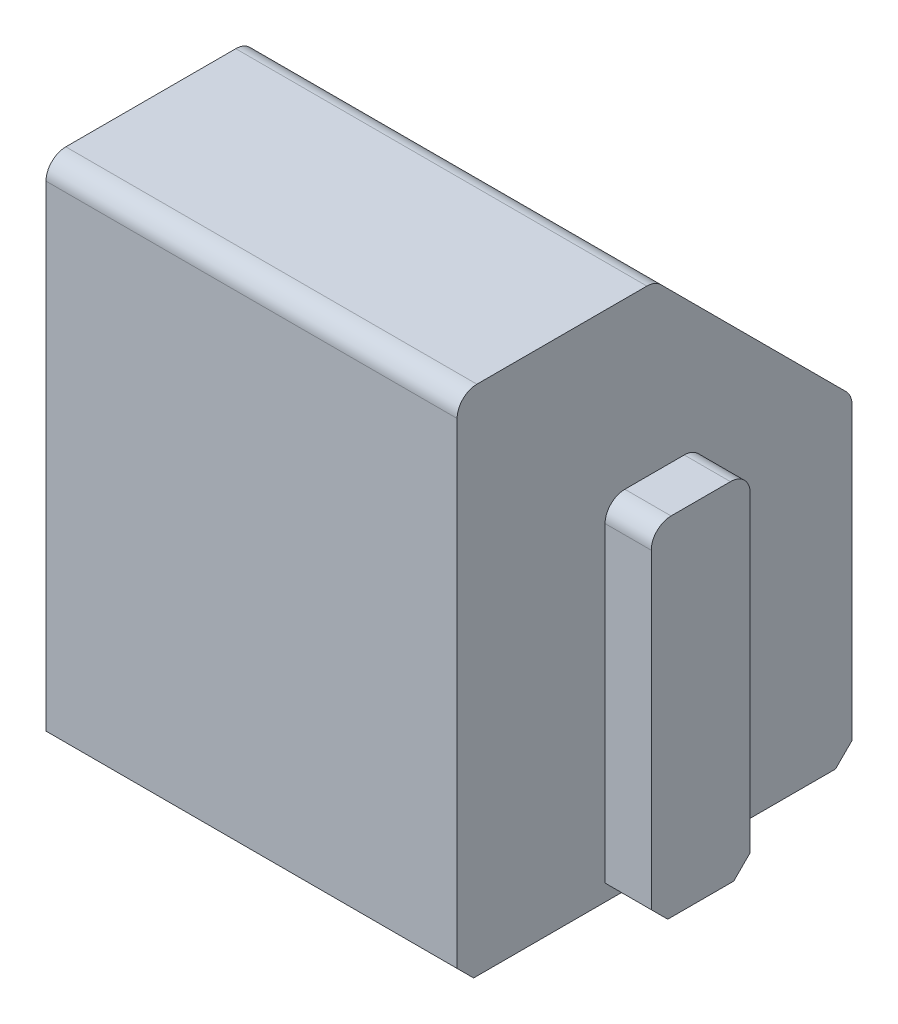
ISO-10303-21;
HEADER;
FILE_DESCRIPTION(('STEP AP214'),'2;1');
FILE_NAME('part.step','',(''),(''),'','','');
FILE_SCHEMA(('AUTOMOTIVE_DESIGN { 1 0 10303 214 1 1 1 1 }'));
ENDSEC;
DATA;
#1=APPLICATION_CONTEXT('core data for automotive mechanical design processes');
#2=APPLICATION_PROTOCOL_DEFINITION('international standard','automotive_design',2000,#1);
#3=PRODUCT_CONTEXT('',#1,'mechanical');
#4=PRODUCT('Part','Part','',(#3));
#5=PRODUCT_RELATED_PRODUCT_CATEGORY('part','',(#4));
#6=PRODUCT_DEFINITION_FORMATION('','',#4);
#7=PRODUCT_DEFINITION_CONTEXT('part definition',#1,'design');
#8=PRODUCT_DEFINITION('design','',#6,#7);
#9=PRODUCT_DEFINITION_SHAPE('','',#8);
#10=(LENGTH_UNIT() NAMED_UNIT(*) SI_UNIT(.MILLI.,.METRE.));
#11=(NAMED_UNIT(*) PLANE_ANGLE_UNIT() SI_UNIT($,.RADIAN.));
#12=(NAMED_UNIT(*) SI_UNIT($,.STERADIAN.) SOLID_ANGLE_UNIT());
#13=UNCERTAINTY_MEASURE_WITH_UNIT(LENGTH_MEASURE(1.E-05),#10,'distance_accuracy_value','');
#14=(GEOMETRIC_REPRESENTATION_CONTEXT(3) GLOBAL_UNCERTAINTY_ASSIGNED_CONTEXT((#13)) GLOBAL_UNIT_ASSIGNED_CONTEXT((#10,
#11,#12)) REPRESENTATION_CONTEXT('',''));
#15=CARTESIAN_POINT('',(0.,0.,0.));
#16=DIRECTION('',(0.,0.,1.));
#17=DIRECTION('',(1.,0.,0.));
#18=AXIS2_PLACEMENT_3D('',#15,#16,#17);
#19=CARTESIAN_POINT('',(6.23,-38.984,-49.));
#20=DIRECTION('',(0.,0.,-1.));
#21=DIRECTION('',(-1.,0.,0.));
#22=AXIS2_PLACEMENT_3D('',#19,#20,#21);
#23=PLANE('',#22);
#24=DIRECTION('',(0.,-1.,0.));
#25=VECTOR('',#24,1.);
#26=CARTESIAN_POINT('',(-6.23,-38.984,-49.));
#27=LINE('',#26,#25);
#28=CARTESIAN_POINT('',(-6.23,-39.584,-49.));
#29=VERTEX_POINT('',#28);
#30=CARTESIAN_POINT('',(-6.23,-54.02,-49.));
#31=VERTEX_POINT('',#30);
#32=EDGE_CURVE('E230',#29,#31,#27,.T.);
#33=ORIENTED_EDGE('',*,*,#32,.T.);
#34=DIRECTION('',(1.,0.,0.));
#35=VECTOR('',#34,1.);
#36=CARTESIAN_POINT('',(6.23,-54.02,-49.));
#37=LINE('',#36,#35);
#38=CARTESIAN_POINT('',(6.23,-54.02,-49.));
#39=VERTEX_POINT('',#38);
#40=EDGE_CURVE('E41',#31,#39,#37,.T.);
#41=ORIENTED_EDGE('',*,*,#40,.T.);
#42=DIRECTION('',(0.,-1.,0.));
#43=VECTOR('',#42,1.);
#44=CARTESIAN_POINT('',(6.23,-38.984,-49.));
#45=LINE('',#44,#43);
#46=CARTESIAN_POINT('',(6.23,-39.584,-49.));
#47=VERTEX_POINT('',#46);
#48=EDGE_CURVE('E232',#47,#39,#45,.T.);
#49=ORIENTED_EDGE('',*,*,#48,.F.);
#50=DIRECTION('',(-1.,0.,0.));
#51=VECTOR('',#50,1.);
#52=CARTESIAN_POINT('',(6.23,-39.584,-49.));
#53=LINE('',#52,#51);
#54=EDGE_CURVE('E286',#47,#29,#53,.T.);
#55=ORIENTED_EDGE('',*,*,#54,.T.);
#56=EDGE_LOOP('',(#33,#41,#49,#55));
#57=FACE_BOUND('',#56,.T.);
#58=ADVANCED_FACE('F17',(#57),#23,.F.);
#59=CARTESIAN_POINT('',(6.23,-54.52,-49.));
#60=DIRECTION('',(0.,1.,0.));
#61=DIRECTION('',(0.,0.,1.));
#62=AXIS2_PLACEMENT_3D('',#59,#60,#61);
#63=PLANE('',#62);
#64=CARTESIAN_POINT('',(0.,-54.52,-54.984));
#65=DIRECTION('',(0.,1.,0.));
#66=DIRECTION('',(0.,0.,1.));
#67=AXIS2_PLACEMENT_3D('',#64,#65,#66);
#68=CIRCLE('',#67,4.);
#69=CARTESIAN_POINT('',(0.,-54.52,-50.984));
#70=VERTEX_POINT('',#69);
#71=EDGE_CURVE('E315',#70,#70,#68,.T.);
#72=ORIENTED_EDGE('',*,*,#71,.T.);
#73=EDGE_LOOP('',(#72));
#74=FACE_BOUND('',#73,.T.);
#75=DIRECTION('',(0.,0.,-1.));
#76=VECTOR('',#75,1.);
#77=CARTESIAN_POINT('',(-7.63,-54.52,-53.484));
#78=LINE('',#77,#76);
#79=CARTESIAN_POINT('',(-7.63,-54.52,-53.984));
#80=VERTEX_POINT('',#79);
#81=CARTESIAN_POINT('',(-7.63,-54.52,-55.984));
#82=VERTEX_POINT('',#81);
#83=EDGE_CURVE('E398',#80,#82,#78,.T.);
#84=ORIENTED_EDGE('',*,*,#83,.T.);
#85=DIRECTION('',(1.,0.,0.));
#86=VECTOR('',#85,1.);
#87=CARTESIAN_POINT('',(-6.23,-54.52,-55.984));
#88=LINE('',#87,#86);
#89=CARTESIAN_POINT('',(-6.23,-54.52,-55.984));
#90=VERTEX_POINT('',#89);
#91=EDGE_CURVE('E330',#82,#90,#88,.T.);
#92=ORIENTED_EDGE('',*,*,#91,.T.);
#93=DIRECTION('',(0.,0.,-1.));
#94=VECTOR('',#93,1.);
#95=CARTESIAN_POINT('',(-6.23,-54.52,-49.));
#96=LINE('',#95,#94);
#97=CARTESIAN_POINT('',(-6.23,-54.52,-60.468));
#98=VERTEX_POINT('',#97);
#99=EDGE_CURVE('E246',#90,#98,#96,.T.);
#100=ORIENTED_EDGE('',*,*,#99,.T.);
#101=DIRECTION('',(1.,0.,0.));
#102=VECTOR('',#101,1.);
#103=CARTESIAN_POINT('',(6.23,-54.52,-60.468));
#104=LINE('',#103,#102);
#105=CARTESIAN_POINT('',(6.23,-54.52,-60.468));
#106=VERTEX_POINT('',#105);
#107=EDGE_CURVE('E318',#98,#106,#104,.T.);
#108=ORIENTED_EDGE('',*,*,#107,.T.);
#109=DIRECTION('',(0.,0.,-1.));
#110=VECTOR('',#109,1.);
#111=CARTESIAN_POINT('',(6.23,-54.52,-49.));
#112=LINE('',#111,#110);
#113=CARTESIAN_POINT('',(6.23,-54.52,-55.984));
#114=VERTEX_POINT('',#113);
#115=EDGE_CURVE('E234',#114,#106,#112,.T.);
#116=ORIENTED_EDGE('',*,*,#115,.F.);
#117=DIRECTION('',(1.,0.,0.));
#118=VECTOR('',#117,1.);
#119=CARTESIAN_POINT('',(6.23,-54.52,-55.984));
#120=LINE('',#119,#118);
#121=CARTESIAN_POINT('',(7.63,-54.52,-55.984));
#122=VERTEX_POINT('',#121);
#123=EDGE_CURVE('E326',#114,#122,#120,.T.);
#124=ORIENTED_EDGE('',*,*,#123,.T.);
#125=DIRECTION('',(0.,0.,-1.));
#126=VECTOR('',#125,1.);
#127=CARTESIAN_POINT('',(7.63,-54.52,-53.484));
#128=LINE('',#127,#126);
#129=CARTESIAN_POINT('',(7.63,-54.52,-53.984));
#130=VERTEX_POINT('',#129);
#131=EDGE_CURVE('E231',#130,#122,#128,.T.);
#132=ORIENTED_EDGE('',*,*,#131,.F.);
#133=DIRECTION('',(-1.,0.,0.));
#134=VECTOR('',#133,1.);
#135=CARTESIAN_POINT('',(6.23,-54.52,-53.984));
#136=LINE('',#135,#134);
#137=CARTESIAN_POINT('',(6.23,-54.52,-53.984));
#138=VERTEX_POINT('',#137);
#139=EDGE_CURVE('E323',#130,#138,#136,.T.);
#140=ORIENTED_EDGE('',*,*,#139,.T.);
#141=CARTESIAN_POINT('',(6.23,-54.52,-49.5));
#142=VERTEX_POINT('',#141);
#143=EDGE_CURVE('E236',#142,#138,#112,.T.);
#144=ORIENTED_EDGE('',*,*,#143,.F.);
#145=DIRECTION('',(-1.,0.,0.));
#146=VECTOR('',#145,1.);
#147=CARTESIAN_POINT('',(6.23,-54.52,-49.5));
#148=LINE('',#147,#146);
#149=CARTESIAN_POINT('',(-6.23,-54.52,-49.5));
#150=VERTEX_POINT('',#149);
#151=EDGE_CURVE('E320',#142,#150,#148,.T.);
#152=ORIENTED_EDGE('',*,*,#151,.T.);
#153=CARTESIAN_POINT('',(-6.23,-54.52,-53.984));
#154=VERTEX_POINT('',#153);
#155=EDGE_CURVE('E247',#150,#154,#96,.T.);
#156=ORIENTED_EDGE('',*,*,#155,.T.);
#157=DIRECTION('',(-1.,0.,0.));
#158=VECTOR('',#157,1.);
#159=CARTESIAN_POINT('',(-7.63,-54.52,-53.984));
#160=LINE('',#159,#158);
#161=EDGE_CURVE('E328',#154,#80,#160,.T.);
#162=ORIENTED_EDGE('',*,*,#161,.T.);
#163=EDGE_LOOP('',(#84,#92,#100,#108,#116,#124,#132,#140,#144,#152,#156,#162));
#164=FACE_BOUND('',#163,.T.);
#165=ADVANCED_FACE('F380',(#74,#164),#63,.F.);
#166=CARTESIAN_POINT('',(6.23,-44.952,-60.968));
#167=DIRECTION('',(0.,0.,1.));
#168=DIRECTION('',(0.,-1.,0.));
#169=AXIS2_PLACEMENT_3D('',#166,#167,#168);
#170=PLANE('',#169);
#171=DIRECTION('',(0.,1.,0.));
#172=VECTOR('',#171,1.);
#173=CARTESIAN_POINT('',(6.23,-44.952,-60.968));
#174=LINE('',#173,#172);
#175=CARTESIAN_POINT('',(6.23,-54.02,-60.968));
#176=VERTEX_POINT('',#175);
#177=CARTESIAN_POINT('',(6.23,-45.2005281374239,-60.968));
#178=VERTEX_POINT('',#177);
#179=EDGE_CURVE('E238',#176,#178,#174,.T.);
#180=ORIENTED_EDGE('',*,*,#179,.F.);
#181=DIRECTION('',(-1.,0.,0.));
#182=VECTOR('',#181,1.);
#183=CARTESIAN_POINT('',(6.23,-54.02,-60.968));
#184=LINE('',#183,#182);
#185=CARTESIAN_POINT('',(-6.23,-54.02,-60.968));
#186=VERTEX_POINT('',#185);
#187=EDGE_CURVE('E359',#176,#186,#184,.T.);
#188=ORIENTED_EDGE('',*,*,#187,.T.);
#189=DIRECTION('',(0.,1.,0.));
#190=VECTOR('',#189,1.);
#191=CARTESIAN_POINT('',(-6.23,-44.952,-60.968));
#192=LINE('',#191,#190);
#193=CARTESIAN_POINT('',(-6.23,-45.2005281374239,-60.968));
#194=VERTEX_POINT('',#193);
#195=EDGE_CURVE('E249',#186,#194,#192,.T.);
#196=ORIENTED_EDGE('',*,*,#195,.T.);
#197=DIRECTION('',(-1.,0.,0.));
#198=VECTOR('',#197,1.);
#199=CARTESIAN_POINT('',(6.23,-45.2005281374239,-60.968));
#200=LINE('',#199,#198);
#201=EDGE_CURVE('E312',#194,#178,#200,.F.);
#202=ORIENTED_EDGE('',*,*,#201,.T.);
#203=EDGE_LOOP('',(#180,#188,#196,#202));
#204=FACE_BOUND('',#203,.T.);
#205=ADVANCED_FACE('F437',(#204),#170,.F.);
#206=CARTESIAN_POINT('',(6.23,-38.984,-55.));
#207=DIRECTION('',(0.,-0.707106781186547,0.707106781186549));
#208=DIRECTION('',(0.,-0.707106781186549,-0.707106781186547));
#209=AXIS2_PLACEMENT_3D('',#206,#207,#208);
#210=PLANE('',#209);
#211=DIRECTION('',(0.,0.707106781186549,0.707106781186546));
#212=VECTOR('',#211,1.);
#213=CARTESIAN_POINT('',(-6.23,-38.984,-55.));
#214=LINE('',#213,#212);
#215=CARTESIAN_POINT('',(-6.23,-44.7762640687119,-60.7922640687119));
#216=VERTEX_POINT('',#215);
#217=CARTESIAN_POINT('',(-6.23,-39.159735931288,-55.1757359312881));
#218=VERTEX_POINT('',#217);
#219=EDGE_CURVE('E251',#216,#218,#214,.T.);
#220=ORIENTED_EDGE('',*,*,#219,.T.);
#221=DIRECTION('',(-1.,0.,0.));
#222=VECTOR('',#221,1.);
#223=CARTESIAN_POINT('',(6.23,-39.159735931288,-55.1757359312881));
#224=LINE('',#223,#222);
#225=CARTESIAN_POINT('',(6.23,-39.159735931288,-55.1757359312881));
#226=VERTEX_POINT('',#225);
#227=EDGE_CURVE('E310',#218,#226,#224,.F.);
#228=ORIENTED_EDGE('',*,*,#227,.T.);
#229=DIRECTION('',(0.,0.707106781186549,0.707106781186546));
#230=VECTOR('',#229,1.);
#231=CARTESIAN_POINT('',(6.23,-38.984,-55.));
#232=LINE('',#231,#230);
#233=CARTESIAN_POINT('',(6.23,-44.7762640687119,-60.7922640687119));
#234=VERTEX_POINT('',#233);
#235=EDGE_CURVE('E240',#234,#226,#232,.T.);
#236=ORIENTED_EDGE('',*,*,#235,.F.);
#237=DIRECTION('',(-1.,0.,0.));
#238=VECTOR('',#237,1.);
#239=CARTESIAN_POINT('',(6.23,-44.7762640687119,-60.7922640687119));
#240=LINE('',#239,#238);
#241=EDGE_CURVE('E307',#234,#216,#240,.T.);
#242=ORIENTED_EDGE('',*,*,#241,.T.);
#243=EDGE_LOOP('',(#220,#228,#236,#242));
#244=FACE_BOUND('',#243,.T.);
#245=ADVANCED_FACE('F526',(#244),#210,.F.);
#246=CARTESIAN_POINT('',(6.23,-38.984,-49.));
#247=DIRECTION('',(0.,-1.,0.));
#248=DIRECTION('',(0.,0.,-1.));
#249=AXIS2_PLACEMENT_3D('',#246,#247,#248);
#250=PLANE('',#249);
#251=DIRECTION('',(0.,0.,1.));
#252=VECTOR('',#251,1.);
#253=CARTESIAN_POINT('',(-6.23,-38.984,-49.));
#254=LINE('',#253,#252);
#255=CARTESIAN_POINT('',(-6.23,-38.984,-54.7514718625762));
#256=VERTEX_POINT('',#255);
#257=CARTESIAN_POINT('',(-6.23,-38.984,-49.6));
#258=VERTEX_POINT('',#257);
#259=EDGE_CURVE('E235',#256,#258,#254,.T.);
#260=ORIENTED_EDGE('',*,*,#259,.T.);
#261=DIRECTION('',(-1.,0.,0.));
#262=VECTOR('',#261,1.);
#263=CARTESIAN_POINT('',(6.23,-38.984,-49.6));
#264=LINE('',#263,#262);
#265=CARTESIAN_POINT('',(6.23,-38.984,-49.6));
#266=VERTEX_POINT('',#265);
#267=EDGE_CURVE('E299',#258,#266,#264,.F.);
#268=ORIENTED_EDGE('',*,*,#267,.T.);
#269=DIRECTION('',(0.,0.,1.));
#270=VECTOR('',#269,1.);
#271=CARTESIAN_POINT('',(6.23,-38.984,-49.));
#272=LINE('',#271,#270);
#273=CARTESIAN_POINT('',(6.23,-38.984,-54.7514718625762));
#274=VERTEX_POINT('',#273);
#275=EDGE_CURVE('E214',#274,#266,#272,.T.);
#276=ORIENTED_EDGE('',*,*,#275,.F.);
#277=DIRECTION('',(-1.,0.,0.));
#278=VECTOR('',#277,1.);
#279=CARTESIAN_POINT('',(6.23,-38.984,-54.7514718625762));
#280=LINE('',#279,#278);
#281=EDGE_CURVE('E296',#274,#256,#280,.T.);
#282=ORIENTED_EDGE('',*,*,#281,.T.);
#283=EDGE_LOOP('',(#260,#268,#276,#282));
#284=FACE_BOUND('',#283,.T.);
#285=ADVANCED_FACE('F532',(#284),#250,.F.);
#286=CARTESIAN_POINT('',(6.23,0.,0.));
#287=DIRECTION('',(1.,0.,0.));
#288=DIRECTION('',(0.,0.,-1.));
#289=AXIS2_PLACEMENT_3D('',#286,#287,#288);
#290=PLANE('',#289);
#291=ORIENTED_EDGE('',*,*,#48,.T.);
#292=DIRECTION('',(0.,0.707106781186548,0.707106781186548));
#293=VECTOR('',#292,1.);
#294=CARTESIAN_POINT('',(6.23,-2.51,2.51));
#295=LINE('',#294,#293);
#296=EDGE_CURVE('E357',#39,#142,#295,.F.);
#297=ORIENTED_EDGE('',*,*,#296,.T.);
#298=ORIENTED_EDGE('',*,*,#143,.T.);
#299=DIRECTION('',(0.,-0.707106781186548,-0.707106781186548));
#300=VECTOR('',#299,1.);
#301=CARTESIAN_POINT('',(6.23,-54.52,-53.984));
#302=LINE('',#301,#300);
#303=CARTESIAN_POINT('',(6.23,-54.02,-53.484));
#304=VERTEX_POINT('',#303);
#305=EDGE_CURVE('E11',#138,#304,#302,.F.);
#306=ORIENTED_EDGE('',*,*,#305,.T.);
#307=DIRECTION('',(0.,-1.,0.));
#308=VECTOR('',#307,1.);
#309=CARTESIAN_POINT('',(6.23,-43.984,-53.484));
#310=LINE('',#309,#308);
#311=CARTESIAN_POINT('',(6.23,-44.584,-53.484));
#312=VERTEX_POINT('',#311);
#313=EDGE_CURVE('E209',#312,#304,#310,.T.);
#314=ORIENTED_EDGE('',*,*,#313,.F.);
#315=CARTESIAN_POINT('',(6.23,-44.584,-54.084));
#316=DIRECTION('',(1.,0.,0.));
#317=DIRECTION('',(0.,0.,-1.));
#318=AXIS2_PLACEMENT_3D('',#315,#316,#317);
#319=CIRCLE('',#318,0.6);
#320=CARTESIAN_POINT('',(6.23,-43.984,-54.084));
#321=VERTEX_POINT('',#320);
#322=EDGE_CURVE('E193',#312,#321,#319,.F.);
#323=ORIENTED_EDGE('',*,*,#322,.T.);
#324=DIRECTION('',(0.,0.,1.));
#325=VECTOR('',#324,1.);
#326=CARTESIAN_POINT('',(6.23,-43.984,-53.484));
#327=LINE('',#326,#325);
#328=CARTESIAN_POINT('',(6.23,-43.984,-55.884));
#329=VERTEX_POINT('',#328);
#330=EDGE_CURVE('E219',#329,#321,#327,.T.);
#331=ORIENTED_EDGE('',*,*,#330,.F.);
#332=CARTESIAN_POINT('',(6.23,-44.584,-55.884));
#333=DIRECTION('',(1.,0.,0.));
#334=DIRECTION('',(0.,0.,-1.));
#335=AXIS2_PLACEMENT_3D('',#332,#333,#334);
#336=CIRCLE('',#335,0.6);
#337=CARTESIAN_POINT('',(6.23,-44.584,-56.484));
#338=VERTEX_POINT('',#337);
#339=EDGE_CURVE('E202',#329,#338,#336,.F.);
#340=ORIENTED_EDGE('',*,*,#339,.T.);
#341=DIRECTION('',(0.,1.,0.));
#342=VECTOR('',#341,1.);
#343=CARTESIAN_POINT('',(6.23,-43.984,-56.484));
#344=LINE('',#343,#342);
#345=CARTESIAN_POINT('',(6.23,-54.02,-56.484));
#346=VERTEX_POINT('',#345);
#347=EDGE_CURVE('E223',#346,#338,#344,.T.);
#348=ORIENTED_EDGE('',*,*,#347,.F.);
#349=DIRECTION('',(0.,0.707106781186548,-0.707106781186548));
#350=VECTOR('',#349,1.);
#351=CARTESIAN_POINT('',(6.23,-54.02,-56.484));
#352=LINE('',#351,#350);
#353=EDGE_CURVE('E26',#346,#114,#352,.F.);
#354=ORIENTED_EDGE('',*,*,#353,.T.);
#355=ORIENTED_EDGE('',*,*,#115,.T.);
#356=DIRECTION('',(0.,-0.707106781186548,0.707106781186548));
#357=VECTOR('',#356,1.);
#358=CARTESIAN_POINT('',(6.23,-57.494,-57.494));
#359=LINE('',#358,#357);
#360=EDGE_CURVE('E33',#106,#176,#359,.F.);
#361=ORIENTED_EDGE('',*,*,#360,.T.);
#362=ORIENTED_EDGE('',*,*,#179,.T.);
#363=CARTESIAN_POINT('',(6.23,-45.2005281374239,-60.368));
#364=DIRECTION('',(1.,0.,0.));
#365=DIRECTION('',(0.,0.,-1.));
#366=AXIS2_PLACEMENT_3D('',#363,#364,#365);
#367=CIRCLE('',#366,0.6);
#368=EDGE_CURVE('E301',#178,#234,#367,.T.);
#369=ORIENTED_EDGE('',*,*,#368,.T.);
#370=ORIENTED_EDGE('',*,*,#235,.T.);
#371=CARTESIAN_POINT('',(6.23,-39.584,-54.7514718625762));
#372=DIRECTION('',(1.,0.,0.));
#373=DIRECTION('',(0.,0.,-1.));
#374=AXIS2_PLACEMENT_3D('',#371,#372,#373);
#375=CIRCLE('',#374,0.6);
#376=EDGE_CURVE('E303',#226,#274,#375,.T.);
#377=ORIENTED_EDGE('',*,*,#376,.T.);
#378=ORIENTED_EDGE('',*,*,#275,.T.);
#379=CARTESIAN_POINT('',(6.23,-39.584,-49.6));
#380=DIRECTION('',(1.,0.,0.));
#381=DIRECTION('',(0.,0.,-1.));
#382=AXIS2_PLACEMENT_3D('',#379,#380,#381);
#383=CIRCLE('',#382,0.6);
#384=EDGE_CURVE('E305',#266,#47,#383,.T.);
#385=ORIENTED_EDGE('',*,*,#384,.T.);
#386=EDGE_LOOP('',(#291,#297,#298,#306,#314,#323,#331,#340,#348,#354,#355,#361,#362,#369,#370,
#377,#378,#385));
#387=FACE_BOUND('',#386,.T.);
#388=ADVANCED_FACE('F216',(#387),#290,.T.);
#389=CARTESIAN_POINT('',(-6.23,0.,0.));
#390=DIRECTION('',(1.,0.,0.));
#391=DIRECTION('',(0.,0.,-1.));
#392=AXIS2_PLACEMENT_3D('',#389,#390,#391);
#393=PLANE('',#392);
#394=ORIENTED_EDGE('',*,*,#155,.F.);
#395=DIRECTION('',(0.,-0.707106781186548,-0.707106781186548));
#396=VECTOR('',#395,1.);
#397=CARTESIAN_POINT('',(-6.23,-54.52,-49.5));
#398=LINE('',#397,#396);
#399=EDGE_CURVE('E353',#150,#31,#398,.F.);
#400=ORIENTED_EDGE('',*,*,#399,.T.);
#401=ORIENTED_EDGE('',*,*,#32,.F.);
#402=CARTESIAN_POINT('',(-6.23,-39.584,-49.6));
#403=DIRECTION('',(1.,0.,0.));
#404=DIRECTION('',(0.,0.,-1.));
#405=AXIS2_PLACEMENT_3D('',#402,#403,#404);
#406=CIRCLE('',#405,0.6);
#407=EDGE_CURVE('E294',#29,#258,#406,.F.);
#408=ORIENTED_EDGE('',*,*,#407,.T.);
#409=ORIENTED_EDGE('',*,*,#259,.F.);
#410=CARTESIAN_POINT('',(-6.23,-39.584,-54.7514718625762));
#411=DIRECTION('',(1.,0.,0.));
#412=DIRECTION('',(0.,0.,-1.));
#413=AXIS2_PLACEMENT_3D('',#410,#411,#412);
#414=CIRCLE('',#413,0.6);
#415=EDGE_CURVE('E292',#256,#218,#414,.F.);
#416=ORIENTED_EDGE('',*,*,#415,.T.);
#417=ORIENTED_EDGE('',*,*,#219,.F.);
#418=CARTESIAN_POINT('',(-6.23,-45.2005281374239,-60.368));
#419=DIRECTION('',(1.,0.,0.));
#420=DIRECTION('',(0.,0.,-1.));
#421=AXIS2_PLACEMENT_3D('',#418,#419,#420);
#422=CIRCLE('',#421,0.6);
#423=EDGE_CURVE('E289',#216,#194,#422,.F.);
#424=ORIENTED_EDGE('',*,*,#423,.T.);
#425=ORIENTED_EDGE('',*,*,#195,.F.);
#426=DIRECTION('',(0.,0.707106781186548,-0.707106781186548));
#427=VECTOR('',#426,1.);
#428=CARTESIAN_POINT('',(-6.23,-54.02,-60.968));
#429=LINE('',#428,#427);
#430=EDGE_CURVE('E351',#186,#98,#429,.F.);
#431=ORIENTED_EDGE('',*,*,#430,.T.);
#432=ORIENTED_EDGE('',*,*,#99,.F.);
#433=DIRECTION('',(0.,0.707106781186548,-0.707106781186548));
#434=VECTOR('',#433,1.);
#435=CARTESIAN_POINT('',(-6.23,-55.252,-55.252));
#436=LINE('',#435,#434);
#437=CARTESIAN_POINT('',(-6.23,-54.02,-56.484));
#438=VERTEX_POINT('',#437);
#439=EDGE_CURVE('E365',#90,#438,#436,.T.);
#440=ORIENTED_EDGE('',*,*,#439,.T.);
#441=DIRECTION('',(0.,1.,0.));
#442=VECTOR('',#441,1.);
#443=CARTESIAN_POINT('',(-6.23,-43.984,-56.484));
#444=LINE('',#443,#442);
#445=CARTESIAN_POINT('',(-6.23,-44.584,-56.484));
#446=VERTEX_POINT('',#445);
#447=EDGE_CURVE('E402',#438,#446,#444,.T.);
#448=ORIENTED_EDGE('',*,*,#447,.T.);
#449=CARTESIAN_POINT('',(-6.23,-44.584,-55.884));
#450=DIRECTION('',(1.,0.,0.));
#451=DIRECTION('',(0.,0.,-1.));
#452=AXIS2_PLACEMENT_3D('',#449,#450,#451);
#453=CIRCLE('',#452,0.6);
#454=CARTESIAN_POINT('',(-6.23,-43.984,-55.884));
#455=VERTEX_POINT('',#454);
#456=EDGE_CURVE('E284',#446,#455,#453,.T.);
#457=ORIENTED_EDGE('',*,*,#456,.T.);
#458=DIRECTION('',(0.,0.,1.));
#459=VECTOR('',#458,1.);
#460=CARTESIAN_POINT('',(-6.23,-43.984,-53.484));
#461=LINE('',#460,#459);
#462=CARTESIAN_POINT('',(-6.23,-43.984,-54.084));
#463=VERTEX_POINT('',#462);
#464=EDGE_CURVE('E407',#455,#463,#461,.T.);
#465=ORIENTED_EDGE('',*,*,#464,.T.);
#466=CARTESIAN_POINT('',(-6.23,-44.584,-54.084));
#467=DIRECTION('',(1.,0.,0.));
#468=DIRECTION('',(0.,0.,-1.));
#469=AXIS2_PLACEMENT_3D('',#466,#467,#468);
#470=CIRCLE('',#469,0.6);
#471=CARTESIAN_POINT('',(-6.23,-44.584,-53.484));
#472=VERTEX_POINT('',#471);
#473=EDGE_CURVE('E282',#463,#472,#470,.T.);
#474=ORIENTED_EDGE('',*,*,#473,.T.);
#475=DIRECTION('',(0.,-1.,0.));
#476=VECTOR('',#475,1.);
#477=CARTESIAN_POINT('',(-6.23,-43.984,-53.484));
#478=LINE('',#477,#476);
#479=CARTESIAN_POINT('',(-6.23,-54.02,-53.484));
#480=VERTEX_POINT('',#479);
#481=EDGE_CURVE('E404',#472,#480,#478,.T.);
#482=ORIENTED_EDGE('',*,*,#481,.T.);
#483=DIRECTION('',(0.,-0.707106781186548,-0.707106781186548));
#484=VECTOR('',#483,1.);
#485=CARTESIAN_POINT('',(-6.23,-0.268,0.268));
#486=LINE('',#485,#484);
#487=EDGE_CURVE('E367',#480,#154,#486,.T.);
#488=ORIENTED_EDGE('',*,*,#487,.T.);
#489=EDGE_LOOP('',(#394,#400,#401,#408,#409,#416,#417,#424,#425,#431,#432,#440,#448,#457,#465,
#474,#482,#488));
#490=FACE_BOUND('',#489,.T.);
#491=ADVANCED_FACE('F517',(#490),#393,.F.);
#492=CARTESIAN_POINT('',(0.,-46.52,-54.984));
#493=DIRECTION('',(0.,-1.,0.));
#494=DIRECTION('',(0.,0.,-1.));
#495=AXIS2_PLACEMENT_3D('',#492,#493,#494);
#496=CYLINDRICAL_SURFACE('',#495,3.5);
#497=CARTESIAN_POINT('',(0.,-54.02,-54.984));
#498=DIRECTION('',(0.,1.,0.));
#499=DIRECTION('',(0.,0.,1.));
#500=AXIS2_PLACEMENT_3D('',#497,#498,#499);
#501=CIRCLE('',#500,3.5);
#502=CARTESIAN_POINT('',(0.,-54.02,-51.484));
#503=VERTEX_POINT('',#502);
#504=EDGE_CURVE('E362',#503,#503,#501,.F.);
#505=ORIENTED_EDGE('',*,*,#504,.T.);
#506=EDGE_LOOP('',(#505));
#507=FACE_BOUND('',#506,.T.);
#508=CARTESIAN_POINT('',(0.,-46.52,-54.984));
#509=DIRECTION('',(0.,-1.,0.));
#510=DIRECTION('',(0.,0.,-1.));
#511=AXIS2_PLACEMENT_3D('',#508,#509,#510);
#512=CIRCLE('',#511,3.5);
#513=CARTESIAN_POINT('',(0.,-46.52,-58.484));
#514=VERTEX_POINT('',#513);
#515=EDGE_CURVE('E227',#514,#514,#512,.T.);
#516=ORIENTED_EDGE('',*,*,#515,.F.);
#517=EDGE_LOOP('',(#516));
#518=FACE_BOUND('',#517,.T.);
#519=ADVANCED_FACE('F429',(#507,#518),#496,.F.);
#520=CARTESIAN_POINT('',(0.,-46.52,-54.984));
#521=DIRECTION('',(0.,-1.,0.));
#522=DIRECTION('',(0.,0.,-1.));
#523=AXIS2_PLACEMENT_3D('',#520,#521,#522);
#524=PLANE('',#523);
#525=ORIENTED_EDGE('',*,*,#515,.T.);
#526=EDGE_LOOP('',(#525));
#527=FACE_BOUND('',#526,.T.);
#528=ADVANCED_FACE('F421',(#527),#524,.T.);
#529=CARTESIAN_POINT('',(7.63,-43.984,-56.484));
#530=DIRECTION('',(0.,0.,1.));
#531=DIRECTION('',(1.,0.,0.));
#532=AXIS2_PLACEMENT_3D('',#529,#530,#531);
#533=PLANE('',#532);
#534=DIRECTION('',(0.,1.,0.));
#535=VECTOR('',#534,1.);
#536=CARTESIAN_POINT('',(7.63,-43.984,-56.484));
#537=LINE('',#536,#535);
#538=CARTESIAN_POINT('',(7.63,-54.02,-56.484));
#539=VERTEX_POINT('',#538);
#540=CARTESIAN_POINT('',(7.63,-44.584,-56.484));
#541=VERTEX_POINT('',#540);
#542=EDGE_CURVE('E218',#539,#541,#537,.T.);
#543=ORIENTED_EDGE('',*,*,#542,.F.);
#544=DIRECTION('',(-1.,0.,0.));
#545=VECTOR('',#544,1.);
#546=CARTESIAN_POINT('',(7.63,-54.02,-56.484));
#547=LINE('',#546,#545);
#548=EDGE_CURVE('E342',#539,#346,#547,.T.);
#549=ORIENTED_EDGE('',*,*,#548,.T.);
#550=ORIENTED_EDGE('',*,*,#347,.T.);
#551=DIRECTION('',(-1.,0.,0.));
#552=VECTOR('',#551,1.);
#553=CARTESIAN_POINT('',(7.63,-44.584,-56.484));
#554=LINE('',#553,#552);
#555=EDGE_CURVE('E203',#338,#541,#554,.F.);
#556=ORIENTED_EDGE('',*,*,#555,.T.);
#557=EDGE_LOOP('',(#543,#549,#550,#556));
#558=FACE_BOUND('',#557,.T.);
#559=ADVANCED_FACE('F419',(#558),#533,.F.);
#560=CARTESIAN_POINT('',(7.63,-43.984,-53.484));
#561=DIRECTION('',(0.,-1.,0.));
#562=DIRECTION('',(0.,0.,-1.));
#563=AXIS2_PLACEMENT_3D('',#560,#561,#562);
#564=PLANE('',#563);
#565=ORIENTED_EDGE('',*,*,#330,.T.);
#566=DIRECTION('',(-1.,0.,0.));
#567=VECTOR('',#566,1.);
#568=CARTESIAN_POINT('',(7.63,-43.984,-54.084));
#569=LINE('',#568,#567);
#570=CARTESIAN_POINT('',(7.63,-43.984,-54.084));
#571=VERTEX_POINT('',#570);
#572=EDGE_CURVE('E198',#321,#571,#569,.F.);
#573=ORIENTED_EDGE('',*,*,#572,.T.);
#574=DIRECTION('',(0.,0.,1.));
#575=VECTOR('',#574,1.);
#576=CARTESIAN_POINT('',(7.63,-43.984,-53.484));
#577=LINE('',#576,#575);
#578=CARTESIAN_POINT('',(7.63,-43.984,-55.884));
#579=VERTEX_POINT('',#578);
#580=EDGE_CURVE('E221',#579,#571,#577,.T.);
#581=ORIENTED_EDGE('',*,*,#580,.F.);
#582=DIRECTION('',(-1.,0.,0.));
#583=VECTOR('',#582,1.);
#584=CARTESIAN_POINT('',(7.63,-43.984,-55.884));
#585=LINE('',#584,#583);
#586=EDGE_CURVE('E213',#579,#329,#585,.T.);
#587=ORIENTED_EDGE('',*,*,#586,.T.);
#588=EDGE_LOOP('',(#565,#573,#581,#587));
#589=FACE_BOUND('',#588,.T.);
#590=ADVANCED_FACE('F415',(#589),#564,.F.);
#591=CARTESIAN_POINT('',(7.63,-43.984,-53.484));
#592=DIRECTION('',(0.,0.,-1.));
#593=DIRECTION('',(-1.,0.,0.));
#594=AXIS2_PLACEMENT_3D('',#591,#592,#593);
#595=PLANE('',#594);
#596=ORIENTED_EDGE('',*,*,#313,.T.);
#597=DIRECTION('',(1.,0.,0.));
#598=VECTOR('',#597,1.);
#599=CARTESIAN_POINT('',(7.63,-54.02,-53.484));
#600=LINE('',#599,#598);
#601=CARTESIAN_POINT('',(7.63,-54.02,-53.484));
#602=VERTEX_POINT('',#601);
#603=EDGE_CURVE('E349',#304,#602,#600,.T.);
#604=ORIENTED_EDGE('',*,*,#603,.T.);
#605=DIRECTION('',(0.,-1.,0.));
#606=VECTOR('',#605,1.);
#607=CARTESIAN_POINT('',(7.63,-43.984,-53.484));
#608=LINE('',#607,#606);
#609=CARTESIAN_POINT('',(7.63,-44.584,-53.484));
#610=VERTEX_POINT('',#609);
#611=EDGE_CURVE('E212',#610,#602,#608,.T.);
#612=ORIENTED_EDGE('',*,*,#611,.F.);
#613=DIRECTION('',(-1.,0.,0.));
#614=VECTOR('',#613,1.);
#615=CARTESIAN_POINT('',(7.63,-44.584,-53.484));
#616=LINE('',#615,#614);
#617=EDGE_CURVE('E197',#610,#312,#616,.T.);
#618=ORIENTED_EDGE('',*,*,#617,.T.);
#619=EDGE_LOOP('',(#596,#604,#612,#618));
#620=FACE_BOUND('',#619,.T.);
#621=ADVANCED_FACE('F208',(#620),#595,.F.);
#622=CARTESIAN_POINT('',(7.63,0.,0.));
#623=DIRECTION('',(1.,0.,0.));
#624=DIRECTION('',(0.,0.,-1.));
#625=AXIS2_PLACEMENT_3D('',#622,#623,#624);
#626=PLANE('',#625);
#627=ORIENTED_EDGE('',*,*,#131,.T.);
#628=DIRECTION('',(0.,-0.707106781186548,0.707106781186548));
#629=VECTOR('',#628,1.);
#630=CARTESIAN_POINT('',(7.63,-55.252,-55.252));
#631=LINE('',#630,#629);
#632=EDGE_CURVE('E347',#122,#539,#631,.F.);
#633=ORIENTED_EDGE('',*,*,#632,.T.);
#634=ORIENTED_EDGE('',*,*,#542,.T.);
#635=CARTESIAN_POINT('',(7.63,-44.584,-55.884));
#636=DIRECTION('',(1.,0.,0.));
#637=DIRECTION('',(0.,0.,-1.));
#638=AXIS2_PLACEMENT_3D('',#635,#636,#637);
#639=CIRCLE('',#638,0.6);
#640=EDGE_CURVE('E259',#541,#579,#639,.T.);
#641=ORIENTED_EDGE('',*,*,#640,.T.);
#642=ORIENTED_EDGE('',*,*,#580,.T.);
#643=CARTESIAN_POINT('',(7.63,-44.584,-54.084));
#644=DIRECTION('',(1.,0.,0.));
#645=DIRECTION('',(0.,0.,-1.));
#646=AXIS2_PLACEMENT_3D('',#643,#644,#645);
#647=CIRCLE('',#646,0.6);
#648=EDGE_CURVE('E261',#571,#610,#647,.T.);
#649=ORIENTED_EDGE('',*,*,#648,.T.);
#650=ORIENTED_EDGE('',*,*,#611,.T.);
#651=DIRECTION('',(0.,0.707106781186548,0.707106781186548));
#652=VECTOR('',#651,1.);
#653=CARTESIAN_POINT('',(7.63,-0.26800000000001,0.26800000000001));
#654=LINE('',#653,#652);
#655=EDGE_CURVE('E345',#602,#130,#654,.F.);
#656=ORIENTED_EDGE('',*,*,#655,.T.);
#657=EDGE_LOOP('',(#627,#633,#634,#641,#642,#649,#650,#656));
#658=FACE_BOUND('',#657,.T.);
#659=ADVANCED_FACE('F383',(#658),#626,.T.);
#660=CARTESIAN_POINT('',(7.63,-44.584,-54.084));
#661=DIRECTION('',(-1.,0.,0.));
#662=DIRECTION('',(0.,0.,1.));
#663=AXIS2_PLACEMENT_3D('',#660,#661,#662);
#664=CYLINDRICAL_SURFACE('',#663,0.6);
#665=ORIENTED_EDGE('',*,*,#648,.F.);
#666=ORIENTED_EDGE('',*,*,#572,.F.);
#667=ORIENTED_EDGE('',*,*,#322,.F.);
#668=ORIENTED_EDGE('',*,*,#617,.F.);
#669=EDGE_LOOP('',(#665,#666,#667,#668));
#670=FACE_BOUND('',#669,.T.);
#671=ADVANCED_FACE('F196',(#670),#664,.T.);
#672=CARTESIAN_POINT('',(7.63,-44.584,-55.884));
#673=DIRECTION('',(-1.,0.,0.));
#674=DIRECTION('',(0.,0.,1.));
#675=AXIS2_PLACEMENT_3D('',#672,#673,#674);
#676=CYLINDRICAL_SURFACE('',#675,0.6);
#677=ORIENTED_EDGE('',*,*,#640,.F.);
#678=ORIENTED_EDGE('',*,*,#555,.F.);
#679=ORIENTED_EDGE('',*,*,#339,.F.);
#680=ORIENTED_EDGE('',*,*,#586,.F.);
#681=EDGE_LOOP('',(#677,#678,#679,#680));
#682=FACE_BOUND('',#681,.T.);
#683=ADVANCED_FACE('F417',(#682),#676,.T.);
#684=CARTESIAN_POINT('',(-7.63,-43.984,-56.484));
#685=DIRECTION('',(0.,0.,-1.));
#686=DIRECTION('',(-1.,0.,0.));
#687=AXIS2_PLACEMENT_3D('',#684,#685,#686);
#688=PLANE('',#687);
#689=ORIENTED_EDGE('',*,*,#447,.F.);
#690=DIRECTION('',(-1.,0.,0.));
#691=VECTOR('',#690,1.);
#692=CARTESIAN_POINT('',(-7.63,-54.02,-56.484));
#693=LINE('',#692,#691);
#694=CARTESIAN_POINT('',(-7.63,-54.02,-56.484));
#695=VERTEX_POINT('',#694);
#696=EDGE_CURVE('E333',#438,#695,#693,.T.);
#697=ORIENTED_EDGE('',*,*,#696,.T.);
#698=DIRECTION('',(0.,1.,0.));
#699=VECTOR('',#698,1.);
#700=CARTESIAN_POINT('',(-7.63,-43.984,-56.484));
#701=LINE('',#700,#699);
#702=CARTESIAN_POINT('',(-7.63,-44.584,-56.484));
#703=VERTEX_POINT('',#702);
#704=EDGE_CURVE('E409',#695,#703,#701,.T.);
#705=ORIENTED_EDGE('',*,*,#704,.T.);
#706=DIRECTION('',(1.,0.,0.));
#707=VECTOR('',#706,1.);
#708=CARTESIAN_POINT('',(-7.63,-44.584,-56.484));
#709=LINE('',#708,#707);
#710=EDGE_CURVE('E279',#703,#446,#709,.T.);
#711=ORIENTED_EDGE('',*,*,#710,.T.);
#712=EDGE_LOOP('',(#689,#697,#705,#711));
#713=FACE_BOUND('',#712,.T.);
#714=ADVANCED_FACE('F446',(#713),#688,.T.);
#715=CARTESIAN_POINT('',(-7.63,-43.984,-53.484));
#716=DIRECTION('',(0.,0.,1.));
#717=DIRECTION('',(1.,0.,0.));
#718=AXIS2_PLACEMENT_3D('',#715,#716,#717);
#719=PLANE('',#718);
#720=DIRECTION('',(0.,-1.,0.));
#721=VECTOR('',#720,1.);
#722=CARTESIAN_POINT('',(-7.63,-43.984,-53.484));
#723=LINE('',#722,#721);
#724=CARTESIAN_POINT('',(-7.63,-44.584,-53.484));
#725=VERTEX_POINT('',#724);
#726=CARTESIAN_POINT('',(-7.63,-54.02,-53.484));
#727=VERTEX_POINT('',#726);
#728=EDGE_CURVE('E392',#725,#727,#723,.T.);
#729=ORIENTED_EDGE('',*,*,#728,.T.);
#730=DIRECTION('',(1.,0.,0.));
#731=VECTOR('',#730,1.);
#732=CARTESIAN_POINT('',(-6.23,-54.02,-53.484));
#733=LINE('',#732,#731);
#734=EDGE_CURVE('E339',#727,#480,#733,.T.);
#735=ORIENTED_EDGE('',*,*,#734,.T.);
#736=ORIENTED_EDGE('',*,*,#481,.F.);
#737=DIRECTION('',(1.,0.,0.));
#738=VECTOR('',#737,1.);
#739=CARTESIAN_POINT('',(-7.63,-44.584,-53.484));
#740=LINE('',#739,#738);
#741=EDGE_CURVE('E272',#472,#725,#740,.F.);
#742=ORIENTED_EDGE('',*,*,#741,.T.);
#743=EDGE_LOOP('',(#729,#735,#736,#742));
#744=FACE_BOUND('',#743,.T.);
#745=ADVANCED_FACE('F550',(#744),#719,.T.);
#746=CARTESIAN_POINT('',(-7.63,-43.984,-53.484));
#747=DIRECTION('',(0.,1.,0.));
#748=DIRECTION('',(0.,0.,1.));
#749=AXIS2_PLACEMENT_3D('',#746,#747,#748);
#750=PLANE('',#749);
#751=DIRECTION('',(0.,0.,1.));
#752=VECTOR('',#751,1.);
#753=CARTESIAN_POINT('',(-7.63,-43.984,-53.484));
#754=LINE('',#753,#752);
#755=CARTESIAN_POINT('',(-7.63,-43.984,-55.884));
#756=VERTEX_POINT('',#755);
#757=CARTESIAN_POINT('',(-7.63,-43.984,-54.084));
#758=VERTEX_POINT('',#757);
#759=EDGE_CURVE('E389',#756,#758,#754,.T.);
#760=ORIENTED_EDGE('',*,*,#759,.T.);
#761=DIRECTION('',(1.,0.,0.));
#762=VECTOR('',#761,1.);
#763=CARTESIAN_POINT('',(-7.63,-43.984,-54.084));
#764=LINE('',#763,#762);
#765=EDGE_CURVE('E269',#758,#463,#764,.T.);
#766=ORIENTED_EDGE('',*,*,#765,.T.);
#767=ORIENTED_EDGE('',*,*,#464,.F.);
#768=DIRECTION('',(1.,0.,0.));
#769=VECTOR('',#768,1.);
#770=CARTESIAN_POINT('',(-7.63,-43.984,-55.884));
#771=LINE('',#770,#769);
#772=EDGE_CURVE('E267',#455,#756,#771,.F.);
#773=ORIENTED_EDGE('',*,*,#772,.T.);
#774=EDGE_LOOP('',(#760,#766,#767,#773));
#775=FACE_BOUND('',#774,.T.);
#776=ADVANCED_FACE('F564',(#775),#750,.T.);
#777=CARTESIAN_POINT('',(-7.63,0.,0.));
#778=DIRECTION('',(-1.,0.,0.));
#779=DIRECTION('',(0.,0.,-1.));
#780=AXIS2_PLACEMENT_3D('',#777,#778,#779);
#781=PLANE('',#780);
#782=ORIENTED_EDGE('',*,*,#704,.F.);
#783=DIRECTION('',(0.,-0.707106781186548,0.707106781186548));
#784=VECTOR('',#783,1.);
#785=CARTESIAN_POINT('',(-7.63,-55.252,-55.252));
#786=LINE('',#785,#784);
#787=EDGE_CURVE('E337',#695,#82,#786,.T.);
#788=ORIENTED_EDGE('',*,*,#787,.T.);
#789=ORIENTED_EDGE('',*,*,#83,.F.);
#790=DIRECTION('',(0.,0.707106781186548,0.707106781186548));
#791=VECTOR('',#790,1.);
#792=CARTESIAN_POINT('',(-7.63,-0.268,0.268));
#793=LINE('',#792,#791);
#794=EDGE_CURVE('E335',#80,#727,#793,.T.);
#795=ORIENTED_EDGE('',*,*,#794,.T.);
#796=ORIENTED_EDGE('',*,*,#728,.F.);
#797=CARTESIAN_POINT('',(-7.63,-44.584,-54.084));
#798=DIRECTION('',(-1.,0.,0.));
#799=DIRECTION('',(0.,0.,1.));
#800=AXIS2_PLACEMENT_3D('',#797,#798,#799);
#801=CIRCLE('',#800,0.6);
#802=EDGE_CURVE('E277',#725,#758,#801,.T.);
#803=ORIENTED_EDGE('',*,*,#802,.T.);
#804=ORIENTED_EDGE('',*,*,#759,.F.);
#805=CARTESIAN_POINT('',(-7.63,-44.584,-55.884));
#806=DIRECTION('',(-1.,0.,0.));
#807=DIRECTION('',(0.,0.,1.));
#808=AXIS2_PLACEMENT_3D('',#805,#806,#807);
#809=CIRCLE('',#808,0.6);
#810=EDGE_CURVE('E274',#756,#703,#809,.T.);
#811=ORIENTED_EDGE('',*,*,#810,.T.);
#812=EDGE_LOOP('',(#782,#788,#789,#795,#796,#803,#804,#811));
#813=FACE_BOUND('',#812,.T.);
#814=ADVANCED_FACE('F451',(#813),#781,.T.);
#815=CARTESIAN_POINT('',(-7.63,-44.584,-54.084));
#816=DIRECTION('',(1.,0.,0.));
#817=DIRECTION('',(0.,0.,-1.));
#818=AXIS2_PLACEMENT_3D('',#815,#816,#817);
#819=CYLINDRICAL_SURFACE('',#818,0.6);
#820=ORIENTED_EDGE('',*,*,#802,.F.);
#821=ORIENTED_EDGE('',*,*,#741,.F.);
#822=ORIENTED_EDGE('',*,*,#473,.F.);
#823=ORIENTED_EDGE('',*,*,#765,.F.);
#824=EDGE_LOOP('',(#820,#821,#822,#823));
#825=FACE_BOUND('',#824,.T.);
#826=ADVANCED_FACE('F447',(#825),#819,.T.);
#827=CARTESIAN_POINT('',(-7.63,-44.584,-55.884));
#828=DIRECTION('',(1.,0.,0.));
#829=DIRECTION('',(0.,0.,-1.));
#830=AXIS2_PLACEMENT_3D('',#827,#828,#829);
#831=CYLINDRICAL_SURFACE('',#830,0.6);
#832=ORIENTED_EDGE('',*,*,#810,.F.);
#833=ORIENTED_EDGE('',*,*,#772,.F.);
#834=ORIENTED_EDGE('',*,*,#456,.F.);
#835=ORIENTED_EDGE('',*,*,#710,.F.);
#836=EDGE_LOOP('',(#832,#833,#834,#835));
#837=FACE_BOUND('',#836,.T.);
#838=ADVANCED_FACE('F450',(#837),#831,.T.);
#839=CARTESIAN_POINT('',(6.23,-39.584,-49.6));
#840=DIRECTION('',(-1.,0.,0.));
#841=DIRECTION('',(0.,0.,1.));
#842=AXIS2_PLACEMENT_3D('',#839,#840,#841);
#843=CYLINDRICAL_SURFACE('',#842,0.6);
#844=ORIENTED_EDGE('',*,*,#384,.F.);
#845=ORIENTED_EDGE('',*,*,#267,.F.);
#846=ORIENTED_EDGE('',*,*,#407,.F.);
#847=ORIENTED_EDGE('',*,*,#54,.F.);
#848=EDGE_LOOP('',(#844,#845,#846,#847));
#849=FACE_BOUND('',#848,.T.);
#850=ADVANCED_FACE('F455',(#849),#843,.T.);
#851=CARTESIAN_POINT('',(6.23,-39.584,-54.7514718625762));
#852=DIRECTION('',(-1.,0.,0.));
#853=DIRECTION('',(0.,0.,1.));
#854=AXIS2_PLACEMENT_3D('',#851,#852,#853);
#855=CYLINDRICAL_SURFACE('',#854,0.6);
#856=ORIENTED_EDGE('',*,*,#376,.F.);
#857=ORIENTED_EDGE('',*,*,#227,.F.);
#858=ORIENTED_EDGE('',*,*,#415,.F.);
#859=ORIENTED_EDGE('',*,*,#281,.F.);
#860=EDGE_LOOP('',(#856,#857,#858,#859));
#861=FACE_BOUND('',#860,.T.);
#862=ADVANCED_FACE('F459',(#861),#855,.T.);
#863=CARTESIAN_POINT('',(6.23,-45.2005281374239,-60.368));
#864=DIRECTION('',(-1.,0.,0.));
#865=DIRECTION('',(0.,0.,1.));
#866=AXIS2_PLACEMENT_3D('',#863,#864,#865);
#867=CYLINDRICAL_SURFACE('',#866,0.6);
#868=ORIENTED_EDGE('',*,*,#368,.F.);
#869=ORIENTED_EDGE('',*,*,#201,.F.);
#870=ORIENTED_EDGE('',*,*,#423,.F.);
#871=ORIENTED_EDGE('',*,*,#241,.F.);
#872=EDGE_LOOP('',(#868,#869,#870,#871));
#873=FACE_BOUND('',#872,.T.);
#874=ADVANCED_FACE('F463',(#873),#867,.T.);
#875=CARTESIAN_POINT('',(6.23,-54.52,-55.984));
#876=DIRECTION('',(0.,-0.707106781186548,-0.707106781186548));
#877=DIRECTION('',(-1.,0.,0.));
#878=AXIS2_PLACEMENT_3D('',#875,#876,#877);
#879=PLANE('',#878);
#880=ORIENTED_EDGE('',*,*,#787,.F.);
#881=ORIENTED_EDGE('',*,*,#696,.F.);
#882=ORIENTED_EDGE('',*,*,#439,.F.);
#883=ORIENTED_EDGE('',*,*,#91,.F.);
#884=EDGE_LOOP('',(#880,#881,#882,#883));
#885=FACE_BOUND('',#884,.T.);
#886=ADVANCED_FACE('F467',(#885),#879,.T.);
#887=CARTESIAN_POINT('',(-7.63,-54.02,-53.484));
#888=DIRECTION('',(0.,-0.707106781186548,0.707106781186548));
#889=DIRECTION('',(-1.,0.,0.));
#890=AXIS2_PLACEMENT_3D('',#887,#888,#889);
#891=PLANE('',#890);
#892=ORIENTED_EDGE('',*,*,#794,.F.);
#893=ORIENTED_EDGE('',*,*,#161,.F.);
#894=ORIENTED_EDGE('',*,*,#487,.F.);
#895=ORIENTED_EDGE('',*,*,#734,.F.);
#896=EDGE_LOOP('',(#892,#893,#894,#895));
#897=FACE_BOUND('',#896,.T.);
#898=ADVANCED_FACE('F476',(#897),#891,.T.);
#899=CARTESIAN_POINT('',(7.63,-54.02,-56.484));
#900=DIRECTION('',(0.,0.707106781186548,0.707106781186548));
#901=DIRECTION('',(-1.,0.,0.));
#902=AXIS2_PLACEMENT_3D('',#899,#900,#901);
#903=PLANE('',#902);
#904=ORIENTED_EDGE('',*,*,#632,.F.);
#905=ORIENTED_EDGE('',*,*,#123,.F.);
#906=ORIENTED_EDGE('',*,*,#353,.F.);
#907=ORIENTED_EDGE('',*,*,#548,.F.);
#908=EDGE_LOOP('',(#904,#905,#906,#907));
#909=FACE_BOUND('',#908,.T.);
#910=ADVANCED_FACE('F375',(#909),#903,.F.);
#911=CARTESIAN_POINT('',(6.23,-54.52,-53.984));
#912=DIRECTION('',(0.,0.707106781186548,-0.707106781186548));
#913=DIRECTION('',(-1.,0.,0.));
#914=AXIS2_PLACEMENT_3D('',#911,#912,#913);
#915=PLANE('',#914);
#916=ORIENTED_EDGE('',*,*,#655,.F.);
#917=ORIENTED_EDGE('',*,*,#603,.F.);
#918=ORIENTED_EDGE('',*,*,#305,.F.);
#919=ORIENTED_EDGE('',*,*,#139,.F.);
#920=EDGE_LOOP('',(#916,#917,#918,#919));
#921=FACE_BOUND('',#920,.T.);
#922=ADVANCED_FACE('F489',(#921),#915,.F.);
#923=CARTESIAN_POINT('',(6.23,-54.52,-49.5));
#924=DIRECTION('',(0.,0.707106781186548,-0.707106781186548));
#925=DIRECTION('',(-1.,0.,0.));
#926=AXIS2_PLACEMENT_3D('',#923,#924,#925);
#927=PLANE('',#926);
#928=ORIENTED_EDGE('',*,*,#296,.F.);
#929=ORIENTED_EDGE('',*,*,#40,.F.);
#930=ORIENTED_EDGE('',*,*,#399,.F.);
#931=ORIENTED_EDGE('',*,*,#151,.F.);
#932=EDGE_LOOP('',(#928,#929,#930,#931));
#933=FACE_BOUND('',#932,.T.);
#934=ADVANCED_FACE('F495',(#933),#927,.F.);
#935=CARTESIAN_POINT('',(6.23,-54.02,-60.968));
#936=DIRECTION('',(0.,0.707106781186548,0.707106781186548));
#937=DIRECTION('',(-1.,0.,0.));
#938=AXIS2_PLACEMENT_3D('',#935,#936,#937);
#939=PLANE('',#938);
#940=ORIENTED_EDGE('',*,*,#360,.F.);
#941=ORIENTED_EDGE('',*,*,#107,.F.);
#942=ORIENTED_EDGE('',*,*,#430,.F.);
#943=ORIENTED_EDGE('',*,*,#187,.F.);
#944=EDGE_LOOP('',(#940,#941,#942,#943));
#945=FACE_BOUND('',#944,.T.);
#946=ADVANCED_FACE('F501',(#945),#939,.F.);
#947=CARTESIAN_POINT('',(0.,-54.02,-54.984));
#948=DIRECTION('',(0.,-1.,0.));
#949=DIRECTION('',(0.,0.,-1.));
#950=AXIS2_PLACEMENT_3D('',#947,#948,#949);
#951=CONICAL_SURFACE('',#950,3.5,0.785398163397447);
#952=ORIENTED_EDGE('',*,*,#71,.F.);
#953=EDGE_LOOP('',(#952));
#954=FACE_BOUND('',#953,.T.);
#955=ORIENTED_EDGE('',*,*,#504,.F.);
#956=EDGE_LOOP('',(#955));
#957=FACE_BOUND('',#956,.T.);
#958=ADVANCED_FACE('F20',(#954,#957),#951,.F.);
#959=CLOSED_SHELL('',(#58,#165,#205,#245,#285,#388,#491,#519,#528,#559,#590,#621,#659,#671,#683,
#714,#745,#776,#814,#826,#838,#850,#862,#874,#886,#898,#910,#922,#934,#946,#958));
#960=MANIFOLD_SOLID_BREP('B1',#959);
#961=ADVANCED_BREP_SHAPE_REPRESENTATION('',(#18,#960),#14);
#962=SHAPE_DEFINITION_REPRESENTATION(#9,#961);
ENDSEC;
END-ISO-10303-21;
